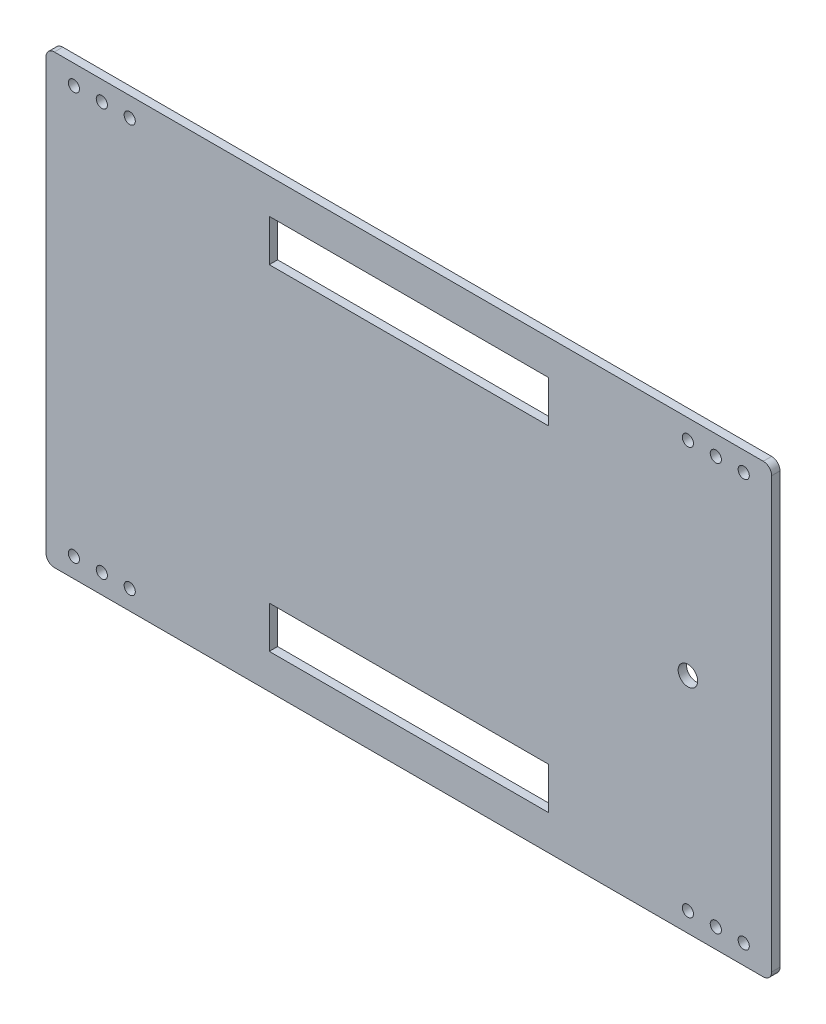
ISO-10303-21;
HEADER;
FILE_DESCRIPTION(('STEP AP214'),'2;1');
FILE_NAME('part.step','',(''),(''),'','','');
FILE_SCHEMA(('AUTOMOTIVE_DESIGN { 1 0 10303 214 1 1 1 1 }'));
ENDSEC;
DATA;
#1=APPLICATION_CONTEXT('core data for automotive mechanical design processes');
#2=APPLICATION_PROTOCOL_DEFINITION('international standard','automotive_design',2000,#1);
#3=PRODUCT_CONTEXT('',#1,'mechanical');
#4=PRODUCT('Part','Part','',(#3));
#5=PRODUCT_RELATED_PRODUCT_CATEGORY('part','',(#4));
#6=PRODUCT_DEFINITION_FORMATION('','',#4);
#7=PRODUCT_DEFINITION_CONTEXT('part definition',#1,'design');
#8=PRODUCT_DEFINITION('design','',#6,#7);
#9=PRODUCT_DEFINITION_SHAPE('','',#8);
#10=(LENGTH_UNIT() NAMED_UNIT(*) SI_UNIT(.MILLI.,.METRE.));
#11=(NAMED_UNIT(*) PLANE_ANGLE_UNIT() SI_UNIT($,.RADIAN.));
#12=(NAMED_UNIT(*) SI_UNIT($,.STERADIAN.) SOLID_ANGLE_UNIT());
#13=UNCERTAINTY_MEASURE_WITH_UNIT(LENGTH_MEASURE(1.E-05),#10,'distance_accuracy_value','');
#14=(GEOMETRIC_REPRESENTATION_CONTEXT(3) GLOBAL_UNCERTAINTY_ASSIGNED_CONTEXT((#13)) GLOBAL_UNIT_ASSIGNED_CONTEXT((#10,
#11,#12)) REPRESENTATION_CONTEXT('',''));
#15=CARTESIAN_POINT('',(0.,0.,0.));
#16=DIRECTION('',(0.,0.,1.));
#17=DIRECTION('',(1.,0.,0.));
#18=AXIS2_PLACEMENT_3D('',#15,#16,#17);
#19=CARTESIAN_POINT('',(127.,77.,3.));
#20=DIRECTION('',(0.,0.,1.));
#21=DIRECTION('',(1.,0.,0.));
#22=AXIS2_PLACEMENT_3D('',#19,#20,#21);
#23=PLANE('',#22);
#24=CARTESIAN_POINT('',(100.,0.,3.));
#25=DIRECTION('',(0.,0.,1.));
#26=DIRECTION('',(1.,0.,0.));
#27=AXIS2_PLACEMENT_3D('',#24,#25,#26);
#28=CIRCLE('',#27,3.50000000000001);
#29=CARTESIAN_POINT('',(103.5,0.,3.));
#30=VERTEX_POINT('',#29);
#31=EDGE_CURVE('E901',#30,#30,#28,.T.);
#32=ORIENTED_EDGE('',*,*,#31,.F.);
#33=EDGE_LOOP('',(#32));
#34=FACE_BOUND('',#33,.T.);
#35=CARTESIAN_POINT('',(100.,-73.,3.));
#36=DIRECTION('',(0.,0.,1.));
#37=DIRECTION('',(1.,0.,0.));
#38=AXIS2_PLACEMENT_3D('',#35,#36,#37);
#39=CIRCLE('',#38,2.);
#40=CARTESIAN_POINT('',(102.,-73.,3.));
#41=VERTEX_POINT('',#40);
#42=EDGE_CURVE('E258',#41,#41,#39,.T.);
#43=ORIENTED_EDGE('',*,*,#42,.F.);
#44=EDGE_LOOP('',(#43));
#45=FACE_BOUND('',#44,.T.);
#46=CARTESIAN_POINT('',(-100.,73.,3.));
#47=DIRECTION('',(0.,0.,1.));
#48=DIRECTION('',(1.,0.,0.));
#49=AXIS2_PLACEMENT_3D('',#46,#47,#48);
#50=CIRCLE('',#49,2.);
#51=CARTESIAN_POINT('',(-98.,73.,3.));
#52=VERTEX_POINT('',#51);
#53=EDGE_CURVE('E274',#52,#52,#50,.T.);
#54=ORIENTED_EDGE('',*,*,#53,.F.);
#55=EDGE_LOOP('',(#54));
#56=FACE_BOUND('',#55,.T.);
#57=CARTESIAN_POINT('',(-120.,-73.,3.));
#58=DIRECTION('',(0.,0.,1.));
#59=DIRECTION('',(1.,0.,0.));
#60=AXIS2_PLACEMENT_3D('',#57,#58,#59);
#61=CIRCLE('',#60,2.00000000000002);
#62=CARTESIAN_POINT('',(-118.,-73.,3.));
#63=VERTEX_POINT('',#62);
#64=EDGE_CURVE('E290',#63,#63,#61,.T.);
#65=ORIENTED_EDGE('',*,*,#64,.F.);
#66=EDGE_LOOP('',(#65));
#67=FACE_BOUND('',#66,.T.);
#68=CARTESIAN_POINT('',(-120.,73.,3.));
#69=DIRECTION('',(0.,0.,1.));
#70=DIRECTION('',(1.,0.,0.));
#71=AXIS2_PLACEMENT_3D('',#68,#69,#70);
#72=CIRCLE('',#71,2.);
#73=CARTESIAN_POINT('',(-118.,73.,3.));
#74=VERTEX_POINT('',#73);
#75=EDGE_CURVE('E306',#74,#74,#72,.T.);
#76=ORIENTED_EDGE('',*,*,#75,.F.);
#77=EDGE_LOOP('',(#76));
#78=FACE_BOUND('',#77,.T.);
#79=CARTESIAN_POINT('',(110.,-73.,3.));
#80=DIRECTION('',(0.,0.,1.));
#81=DIRECTION('',(1.,0.,0.));
#82=AXIS2_PLACEMENT_3D('',#79,#80,#81);
#83=CIRCLE('',#82,2.);
#84=CARTESIAN_POINT('',(112.,-73.,3.));
#85=VERTEX_POINT('',#84);
#86=EDGE_CURVE('E322',#85,#85,#83,.T.);
#87=ORIENTED_EDGE('',*,*,#86,.F.);
#88=EDGE_LOOP('',(#87));
#89=FACE_BOUND('',#88,.T.);
#90=CARTESIAN_POINT('',(-110.,73.,3.));
#91=DIRECTION('',(0.,0.,1.));
#92=DIRECTION('',(1.,0.,0.));
#93=AXIS2_PLACEMENT_3D('',#90,#91,#92);
#94=CIRCLE('',#93,2.);
#95=CARTESIAN_POINT('',(-108.,73.,3.));
#96=VERTEX_POINT('',#95);
#97=EDGE_CURVE('E338',#96,#96,#94,.T.);
#98=ORIENTED_EDGE('',*,*,#97,.F.);
#99=EDGE_LOOP('',(#98));
#100=FACE_BOUND('',#99,.T.);
#101=CARTESIAN_POINT('',(127.,77.,3.));
#102=DIRECTION('',(0.,0.,1.));
#103=DIRECTION('',(1.,0.,0.));
#104=AXIS2_PLACEMENT_3D('',#101,#102,#103);
#105=CIRCLE('',#104,3.);
#106=CARTESIAN_POINT('',(130.,77.,3.));
#107=VERTEX_POINT('',#106);
#108=CARTESIAN_POINT('',(127.,80.,3.));
#109=VERTEX_POINT('',#108);
#110=EDGE_CURVE('E346',#107,#109,#105,.T.);
#111=ORIENTED_EDGE('',*,*,#110,.T.);
#112=DIRECTION('',(-1.,0.,0.));
#113=VECTOR('',#112,1.);
#114=CARTESIAN_POINT('',(127.,80.,3.));
#115=LINE('',#114,#113);
#116=CARTESIAN_POINT('',(-127.,80.,3.));
#117=VERTEX_POINT('',#116);
#118=EDGE_CURVE('E350',#109,#117,#115,.T.);
#119=ORIENTED_EDGE('',*,*,#118,.T.);
#120=CARTESIAN_POINT('',(-127.,77.,3.));
#121=DIRECTION('',(0.,0.,1.));
#122=DIRECTION('',(1.,0.,0.));
#123=AXIS2_PLACEMENT_3D('',#120,#121,#122);
#124=CIRCLE('',#123,3.);
#125=CARTESIAN_POINT('',(-130.,77.,3.));
#126=VERTEX_POINT('',#125);
#127=EDGE_CURVE('E354',#117,#126,#124,.T.);
#128=ORIENTED_EDGE('',*,*,#127,.T.);
#129=DIRECTION('',(0.,-1.,0.));
#130=VECTOR('',#129,1.);
#131=CARTESIAN_POINT('',(-130.,77.,3.));
#132=LINE('',#131,#130);
#133=CARTESIAN_POINT('',(-130.,-77.,3.));
#134=VERTEX_POINT('',#133);
#135=EDGE_CURVE('E357',#126,#134,#132,.T.);
#136=ORIENTED_EDGE('',*,*,#135,.T.);
#137=CARTESIAN_POINT('',(-127.,-77.,3.));
#138=DIRECTION('',(0.,0.,1.));
#139=DIRECTION('',(1.,0.,0.));
#140=AXIS2_PLACEMENT_3D('',#137,#138,#139);
#141=CIRCLE('',#140,3.);
#142=CARTESIAN_POINT('',(-127.,-80.,3.));
#143=VERTEX_POINT('',#142);
#144=EDGE_CURVE('E360',#134,#143,#141,.T.);
#145=ORIENTED_EDGE('',*,*,#144,.T.);
#146=DIRECTION('',(1.,0.,0.));
#147=VECTOR('',#146,1.);
#148=CARTESIAN_POINT('',(-127.,-80.,3.));
#149=LINE('',#148,#147);
#150=CARTESIAN_POINT('',(127.,-80.,3.));
#151=VERTEX_POINT('',#150);
#152=EDGE_CURVE('E363',#143,#151,#149,.T.);
#153=ORIENTED_EDGE('',*,*,#152,.T.);
#154=CARTESIAN_POINT('',(127.,-77.,3.));
#155=DIRECTION('',(0.,0.,1.));
#156=DIRECTION('',(1.,0.,0.));
#157=AXIS2_PLACEMENT_3D('',#154,#155,#156);
#158=CIRCLE('',#157,3.);
#159=CARTESIAN_POINT('',(130.,-77.,3.));
#160=VERTEX_POINT('',#159);
#161=EDGE_CURVE('E366',#151,#160,#158,.T.);
#162=ORIENTED_EDGE('',*,*,#161,.T.);
#163=DIRECTION('',(0.,1.,0.));
#164=VECTOR('',#163,1.);
#165=CARTESIAN_POINT('',(130.,-77.,3.));
#166=LINE('',#165,#164);
#167=EDGE_CURVE('E369',#160,#107,#166,.T.);
#168=ORIENTED_EDGE('',*,*,#167,.T.);
#169=EDGE_LOOP('',(#111,#119,#128,#136,#145,#153,#162,#168));
#170=FACE_BOUND('',#169,.T.);
#171=CARTESIAN_POINT('',(110.,73.,3.));
#172=DIRECTION('',(0.,0.,1.));
#173=DIRECTION('',(1.,0.,0.));
#174=AXIS2_PLACEMENT_3D('',#171,#172,#173);
#175=CIRCLE('',#174,2.);
#176=CARTESIAN_POINT('',(112.,73.,3.));
#177=VERTEX_POINT('',#176);
#178=EDGE_CURVE('E330',#177,#177,#175,.T.);
#179=ORIENTED_EDGE('',*,*,#178,.F.);
#180=EDGE_LOOP('',(#179));
#181=FACE_BOUND('',#180,.T.);
#182=CARTESIAN_POINT('',(-110.,-73.,3.));
#183=DIRECTION('',(0.,0.,1.));
#184=DIRECTION('',(1.,0.,0.));
#185=AXIS2_PLACEMENT_3D('',#182,#183,#184);
#186=CIRCLE('',#185,2.);
#187=CARTESIAN_POINT('',(-108.,-73.,3.));
#188=VERTEX_POINT('',#187);
#189=EDGE_CURVE('E314',#188,#188,#186,.T.);
#190=ORIENTED_EDGE('',*,*,#189,.F.);
#191=EDGE_LOOP('',(#190));
#192=FACE_BOUND('',#191,.T.);
#193=CARTESIAN_POINT('',(120.,73.,3.));
#194=DIRECTION('',(0.,0.,1.));
#195=DIRECTION('',(1.,0.,0.));
#196=AXIS2_PLACEMENT_3D('',#193,#194,#195);
#197=CIRCLE('',#196,2.);
#198=CARTESIAN_POINT('',(122.,73.,3.));
#199=VERTEX_POINT('',#198);
#200=EDGE_CURVE('E298',#199,#199,#197,.T.);
#201=ORIENTED_EDGE('',*,*,#200,.F.);
#202=EDGE_LOOP('',(#201));
#203=FACE_BOUND('',#202,.T.);
#204=CARTESIAN_POINT('',(120.,-73.,3.));
#205=DIRECTION('',(0.,0.,1.));
#206=DIRECTION('',(1.,0.,0.));
#207=AXIS2_PLACEMENT_3D('',#204,#205,#206);
#208=CIRCLE('',#207,2.);
#209=CARTESIAN_POINT('',(122.,-73.,3.));
#210=VERTEX_POINT('',#209);
#211=EDGE_CURVE('E282',#210,#210,#208,.T.);
#212=ORIENTED_EDGE('',*,*,#211,.F.);
#213=EDGE_LOOP('',(#212));
#214=FACE_BOUND('',#213,.T.);
#215=CARTESIAN_POINT('',(100.,73.,3.));
#216=DIRECTION('',(0.,0.,1.));
#217=DIRECTION('',(1.,0.,0.));
#218=AXIS2_PLACEMENT_3D('',#215,#216,#217);
#219=CIRCLE('',#218,2.);
#220=CARTESIAN_POINT('',(102.,73.,3.));
#221=VERTEX_POINT('',#220);
#222=EDGE_CURVE('E266',#221,#221,#219,.T.);
#223=ORIENTED_EDGE('',*,*,#222,.F.);
#224=EDGE_LOOP('',(#223));
#225=FACE_BOUND('',#224,.T.);
#226=CARTESIAN_POINT('',(-100.,-73.,3.));
#227=DIRECTION('',(0.,0.,1.));
#228=DIRECTION('',(1.,0.,0.));
#229=AXIS2_PLACEMENT_3D('',#226,#227,#228);
#230=CIRCLE('',#229,2.00000000000002);
#231=CARTESIAN_POINT('',(-98.,-73.,3.));
#232=VERTEX_POINT('',#231);
#233=EDGE_CURVE('E250',#232,#232,#230,.T.);
#234=ORIENTED_EDGE('',*,*,#233,.F.);
#235=EDGE_LOOP('',(#234));
#236=FACE_BOUND('',#235,.T.);
#237=DIRECTION('',(-1.,0.,0.));
#238=VECTOR('',#237,1.);
#239=CARTESIAN_POINT('',(50.,67.5,3.));
#240=LINE('',#239,#238);
#241=CARTESIAN_POINT('',(50.,67.5,3.));
#242=VERTEX_POINT('',#241);
#243=CARTESIAN_POINT('',(-50.,67.5,3.));
#244=VERTEX_POINT('',#243);
#245=EDGE_CURVE('E210',#242,#244,#240,.T.);
#246=ORIENTED_EDGE('',*,*,#245,.F.);
#247=DIRECTION('',(0.,1.,0.));
#248=VECTOR('',#247,1.);
#249=CARTESIAN_POINT('',(50.,52.5,3.));
#250=LINE('',#249,#248);
#251=CARTESIAN_POINT('',(50.,52.5,3.));
#252=VERTEX_POINT('',#251);
#253=EDGE_CURVE('E207',#252,#242,#250,.T.);
#254=ORIENTED_EDGE('',*,*,#253,.F.);
#255=DIRECTION('',(1.,0.,0.));
#256=VECTOR('',#255,1.);
#257=CARTESIAN_POINT('',(-50.,52.5,3.));
#258=LINE('',#257,#256);
#259=CARTESIAN_POINT('',(-50.,52.5,3.));
#260=VERTEX_POINT('',#259);
#261=EDGE_CURVE('E218',#260,#252,#258,.T.);
#262=ORIENTED_EDGE('',*,*,#261,.F.);
#263=DIRECTION('',(0.,-1.,0.));
#264=VECTOR('',#263,1.);
#265=CARTESIAN_POINT('',(-50.,67.5,3.));
#266=LINE('',#265,#264);
#267=EDGE_CURVE('E214',#244,#260,#266,.T.);
#268=ORIENTED_EDGE('',*,*,#267,.F.);
#269=EDGE_LOOP('',(#246,#254,#262,#268));
#270=FACE_BOUND('',#269,.T.);
#271=DIRECTION('',(1.,0.,0.));
#272=VECTOR('',#271,1.);
#273=CARTESIAN_POINT('',(-50.,-67.5,3.));
#274=LINE('',#273,#272);
#275=CARTESIAN_POINT('',(-50.,-67.5,3.));
#276=VERTEX_POINT('',#275);
#277=CARTESIAN_POINT('',(50.,-67.5,3.));
#278=VERTEX_POINT('',#277);
#279=EDGE_CURVE('E166',#276,#278,#274,.T.);
#280=ORIENTED_EDGE('',*,*,#279,.F.);
#281=DIRECTION('',(0.,-1.,0.));
#282=VECTOR('',#281,1.);
#283=CARTESIAN_POINT('',(-50.,-52.5,3.));
#284=LINE('',#283,#282);
#285=CARTESIAN_POINT('',(-50.,-52.5,3.));
#286=VERTEX_POINT('',#285);
#287=EDGE_CURVE('E157',#286,#276,#284,.T.);
#288=ORIENTED_EDGE('',*,*,#287,.F.);
#289=DIRECTION('',(-1.,0.,0.));
#290=VECTOR('',#289,1.);
#291=CARTESIAN_POINT('',(50.,-52.5,3.));
#292=LINE('',#291,#290);
#293=CARTESIAN_POINT('',(50.,-52.5,3.));
#294=VERTEX_POINT('',#293);
#295=EDGE_CURVE('E183',#294,#286,#292,.T.);
#296=ORIENTED_EDGE('',*,*,#295,.F.);
#297=DIRECTION('',(0.,1.,0.));
#298=VECTOR('',#297,1.);
#299=CARTESIAN_POINT('',(50.,-67.5,3.));
#300=LINE('',#299,#298);
#301=EDGE_CURVE('E179',#278,#294,#300,.T.);
#302=ORIENTED_EDGE('',*,*,#301,.F.);
#303=EDGE_LOOP('',(#280,#288,#296,#302));
#304=FACE_BOUND('',#303,.T.);
#305=ADVANCED_FACE('F43',(#34,#45,#56,#67,#78,#89,#100,#170,#181,#192,#203,#214,#225,#236,#270,
#304),#23,.T.);
#306=CARTESIAN_POINT('',(127.,77.,0.));
#307=DIRECTION('',(0.,0.,1.));
#308=DIRECTION('',(1.,0.,0.));
#309=AXIS2_PLACEMENT_3D('',#306,#307,#308);
#310=PLANE('',#309);
#311=CARTESIAN_POINT('',(100.,0.,0.));
#312=DIRECTION('',(0.,0.,1.));
#313=DIRECTION('',(1.,0.,0.));
#314=AXIS2_PLACEMENT_3D('',#311,#312,#313);
#315=CIRCLE('',#314,3.50000000000001);
#316=CARTESIAN_POINT('',(103.5,0.,0.));
#317=VERTEX_POINT('',#316);
#318=EDGE_CURVE('E191',#317,#317,#315,.T.);
#319=ORIENTED_EDGE('',*,*,#318,.T.);
#320=EDGE_LOOP('',(#319));
#321=FACE_BOUND('',#320,.T.);
#322=DIRECTION('',(0.,1.,0.));
#323=VECTOR('',#322,1.);
#324=CARTESIAN_POINT('',(50.,52.5,0.));
#325=LINE('',#324,#323);
#326=CARTESIAN_POINT('',(50.,52.5,0.));
#327=VERTEX_POINT('',#326);
#328=CARTESIAN_POINT('',(50.,67.5,0.));
#329=VERTEX_POINT('',#328);
#330=EDGE_CURVE('E175',#327,#329,#325,.T.);
#331=ORIENTED_EDGE('',*,*,#330,.T.);
#332=DIRECTION('',(-1.,0.,0.));
#333=VECTOR('',#332,1.);
#334=CARTESIAN_POINT('',(50.,67.5,0.));
#335=LINE('',#334,#333);
#336=CARTESIAN_POINT('',(-50.,67.5,0.));
#337=VERTEX_POINT('',#336);
#338=EDGE_CURVE('E225',#329,#337,#335,.T.);
#339=ORIENTED_EDGE('',*,*,#338,.T.);
#340=DIRECTION('',(0.,-1.,0.));
#341=VECTOR('',#340,1.);
#342=CARTESIAN_POINT('',(-50.,67.5,0.));
#343=LINE('',#342,#341);
#344=CARTESIAN_POINT('',(-50.,52.5,0.));
#345=VERTEX_POINT('',#344);
#346=EDGE_CURVE('E229',#337,#345,#343,.T.);
#347=ORIENTED_EDGE('',*,*,#346,.T.);
#348=DIRECTION('',(1.,0.,0.));
#349=VECTOR('',#348,1.);
#350=CARTESIAN_POINT('',(-50.,52.5,0.));
#351=LINE('',#350,#349);
#352=EDGE_CURVE('E211',#345,#327,#351,.T.);
#353=ORIENTED_EDGE('',*,*,#352,.T.);
#354=EDGE_LOOP('',(#331,#339,#347,#353));
#355=FACE_BOUND('',#354,.T.);
#356=CARTESIAN_POINT('',(127.,77.,0.));
#357=DIRECTION('',(0.,0.,1.));
#358=DIRECTION('',(1.,0.,0.));
#359=AXIS2_PLACEMENT_3D('',#356,#357,#358);
#360=CIRCLE('',#359,3.);
#361=CARTESIAN_POINT('',(130.,77.,0.));
#362=VERTEX_POINT('',#361);
#363=CARTESIAN_POINT('',(127.,80.,0.));
#364=VERTEX_POINT('',#363);
#365=EDGE_CURVE('E342',#362,#364,#360,.T.);
#366=ORIENTED_EDGE('',*,*,#365,.F.);
#367=DIRECTION('',(0.,1.,0.));
#368=VECTOR('',#367,1.);
#369=CARTESIAN_POINT('',(130.,-77.,0.));
#370=LINE('',#369,#368);
#371=CARTESIAN_POINT('',(130.,-77.,0.));
#372=VERTEX_POINT('',#371);
#373=EDGE_CURVE('E351',#372,#362,#370,.T.);
#374=ORIENTED_EDGE('',*,*,#373,.F.);
#375=CARTESIAN_POINT('',(127.,-77.,0.));
#376=DIRECTION('',(0.,0.,1.));
#377=DIRECTION('',(1.,0.,0.));
#378=AXIS2_PLACEMENT_3D('',#375,#376,#377);
#379=CIRCLE('',#378,3.);
#380=CARTESIAN_POINT('',(127.,-80.,0.));
#381=VERTEX_POINT('',#380);
#382=EDGE_CURVE('E391',#381,#372,#379,.T.);
#383=ORIENTED_EDGE('',*,*,#382,.F.);
#384=DIRECTION('',(1.,0.,0.));
#385=VECTOR('',#384,1.);
#386=CARTESIAN_POINT('',(-127.,-80.,0.));
#387=LINE('',#386,#385);
#388=CARTESIAN_POINT('',(-127.,-80.,0.));
#389=VERTEX_POINT('',#388);
#390=EDGE_CURVE('E388',#389,#381,#387,.T.);
#391=ORIENTED_EDGE('',*,*,#390,.F.);
#392=CARTESIAN_POINT('',(-127.,-77.,0.));
#393=DIRECTION('',(0.,0.,1.));
#394=DIRECTION('',(1.,0.,0.));
#395=AXIS2_PLACEMENT_3D('',#392,#393,#394);
#396=CIRCLE('',#395,3.);
#397=CARTESIAN_POINT('',(-130.,-77.,0.));
#398=VERTEX_POINT('',#397);
#399=EDGE_CURVE('E385',#398,#389,#396,.T.);
#400=ORIENTED_EDGE('',*,*,#399,.F.);
#401=DIRECTION('',(0.,-1.,0.));
#402=VECTOR('',#401,1.);
#403=CARTESIAN_POINT('',(-130.,77.,0.));
#404=LINE('',#403,#402);
#405=CARTESIAN_POINT('',(-130.,77.,0.));
#406=VERTEX_POINT('',#405);
#407=EDGE_CURVE('E382',#406,#398,#404,.T.);
#408=ORIENTED_EDGE('',*,*,#407,.F.);
#409=CARTESIAN_POINT('',(-127.,77.,0.));
#410=DIRECTION('',(0.,0.,1.));
#411=DIRECTION('',(1.,0.,0.));
#412=AXIS2_PLACEMENT_3D('',#409,#410,#411);
#413=CIRCLE('',#412,3.);
#414=CARTESIAN_POINT('',(-127.,80.,0.));
#415=VERTEX_POINT('',#414);
#416=EDGE_CURVE('E379',#415,#406,#413,.T.);
#417=ORIENTED_EDGE('',*,*,#416,.F.);
#418=DIRECTION('',(-1.,0.,0.));
#419=VECTOR('',#418,1.);
#420=CARTESIAN_POINT('',(127.,80.,0.));
#421=LINE('',#420,#419);
#422=EDGE_CURVE('E376',#364,#415,#421,.T.);
#423=ORIENTED_EDGE('',*,*,#422,.F.);
#424=EDGE_LOOP('',(#366,#374,#383,#391,#400,#408,#417,#423));
#425=FACE_BOUND('',#424,.T.);
#426=CARTESIAN_POINT('',(-110.,73.,0.));
#427=DIRECTION('',(0.,0.,1.));
#428=DIRECTION('',(1.,0.,0.));
#429=AXIS2_PLACEMENT_3D('',#426,#427,#428);
#430=CIRCLE('',#429,2.);
#431=CARTESIAN_POINT('',(-108.,73.,0.));
#432=VERTEX_POINT('',#431);
#433=EDGE_CURVE('E334',#432,#432,#430,.T.);
#434=ORIENTED_EDGE('',*,*,#433,.T.);
#435=EDGE_LOOP('',(#434));
#436=FACE_BOUND('',#435,.T.);
#437=CARTESIAN_POINT('',(110.,73.,0.));
#438=DIRECTION('',(0.,0.,1.));
#439=DIRECTION('',(1.,0.,0.));
#440=AXIS2_PLACEMENT_3D('',#437,#438,#439);
#441=CIRCLE('',#440,2.);
#442=CARTESIAN_POINT('',(112.,73.,0.));
#443=VERTEX_POINT('',#442);
#444=EDGE_CURVE('E326',#443,#443,#441,.T.);
#445=ORIENTED_EDGE('',*,*,#444,.T.);
#446=EDGE_LOOP('',(#445));
#447=FACE_BOUND('',#446,.T.);
#448=CARTESIAN_POINT('',(110.,-73.,0.));
#449=DIRECTION('',(0.,0.,1.));
#450=DIRECTION('',(1.,0.,0.));
#451=AXIS2_PLACEMENT_3D('',#448,#449,#450);
#452=CIRCLE('',#451,2.);
#453=CARTESIAN_POINT('',(112.,-73.,0.));
#454=VERTEX_POINT('',#453);
#455=EDGE_CURVE('E318',#454,#454,#452,.T.);
#456=ORIENTED_EDGE('',*,*,#455,.T.);
#457=EDGE_LOOP('',(#456));
#458=FACE_BOUND('',#457,.T.);
#459=CARTESIAN_POINT('',(-110.,-73.,0.));
#460=DIRECTION('',(0.,0.,1.));
#461=DIRECTION('',(1.,0.,0.));
#462=AXIS2_PLACEMENT_3D('',#459,#460,#461);
#463=CIRCLE('',#462,2.);
#464=CARTESIAN_POINT('',(-108.,-73.,0.));
#465=VERTEX_POINT('',#464);
#466=EDGE_CURVE('E310',#465,#465,#463,.T.);
#467=ORIENTED_EDGE('',*,*,#466,.T.);
#468=EDGE_LOOP('',(#467));
#469=FACE_BOUND('',#468,.T.);
#470=CARTESIAN_POINT('',(-120.,73.,0.));
#471=DIRECTION('',(0.,0.,1.));
#472=DIRECTION('',(1.,0.,0.));
#473=AXIS2_PLACEMENT_3D('',#470,#471,#472);
#474=CIRCLE('',#473,2.);
#475=CARTESIAN_POINT('',(-118.,73.,0.));
#476=VERTEX_POINT('',#475);
#477=EDGE_CURVE('E302',#476,#476,#474,.T.);
#478=ORIENTED_EDGE('',*,*,#477,.T.);
#479=EDGE_LOOP('',(#478));
#480=FACE_BOUND('',#479,.T.);
#481=CARTESIAN_POINT('',(120.,73.,0.));
#482=DIRECTION('',(0.,0.,1.));
#483=DIRECTION('',(1.,0.,0.));
#484=AXIS2_PLACEMENT_3D('',#481,#482,#483);
#485=CIRCLE('',#484,2.);
#486=CARTESIAN_POINT('',(122.,73.,0.));
#487=VERTEX_POINT('',#486);
#488=EDGE_CURVE('E294',#487,#487,#485,.T.);
#489=ORIENTED_EDGE('',*,*,#488,.T.);
#490=EDGE_LOOP('',(#489));
#491=FACE_BOUND('',#490,.T.);
#492=CARTESIAN_POINT('',(-120.,-73.,0.));
#493=DIRECTION('',(0.,0.,1.));
#494=DIRECTION('',(1.,0.,0.));
#495=AXIS2_PLACEMENT_3D('',#492,#493,#494);
#496=CIRCLE('',#495,2.00000000000002);
#497=CARTESIAN_POINT('',(-118.,-73.,0.));
#498=VERTEX_POINT('',#497);
#499=EDGE_CURVE('E286',#498,#498,#496,.T.);
#500=ORIENTED_EDGE('',*,*,#499,.T.);
#501=EDGE_LOOP('',(#500));
#502=FACE_BOUND('',#501,.T.);
#503=CARTESIAN_POINT('',(120.,-73.,0.));
#504=DIRECTION('',(0.,0.,1.));
#505=DIRECTION('',(1.,0.,0.));
#506=AXIS2_PLACEMENT_3D('',#503,#504,#505);
#507=CIRCLE('',#506,2.);
#508=CARTESIAN_POINT('',(122.,-73.,0.));
#509=VERTEX_POINT('',#508);
#510=EDGE_CURVE('E278',#509,#509,#507,.T.);
#511=ORIENTED_EDGE('',*,*,#510,.T.);
#512=EDGE_LOOP('',(#511));
#513=FACE_BOUND('',#512,.T.);
#514=CARTESIAN_POINT('',(-100.,73.,0.));
#515=DIRECTION('',(0.,0.,1.));
#516=DIRECTION('',(1.,0.,0.));
#517=AXIS2_PLACEMENT_3D('',#514,#515,#516);
#518=CIRCLE('',#517,2.);
#519=CARTESIAN_POINT('',(-98.,73.,0.));
#520=VERTEX_POINT('',#519);
#521=EDGE_CURVE('E270',#520,#520,#518,.T.);
#522=ORIENTED_EDGE('',*,*,#521,.T.);
#523=EDGE_LOOP('',(#522));
#524=FACE_BOUND('',#523,.T.);
#525=CARTESIAN_POINT('',(100.,73.,0.));
#526=DIRECTION('',(0.,0.,1.));
#527=DIRECTION('',(1.,0.,0.));
#528=AXIS2_PLACEMENT_3D('',#525,#526,#527);
#529=CIRCLE('',#528,2.);
#530=CARTESIAN_POINT('',(102.,73.,0.));
#531=VERTEX_POINT('',#530);
#532=EDGE_CURVE('E262',#531,#531,#529,.T.);
#533=ORIENTED_EDGE('',*,*,#532,.T.);
#534=EDGE_LOOP('',(#533));
#535=FACE_BOUND('',#534,.T.);
#536=CARTESIAN_POINT('',(100.,-73.,0.));
#537=DIRECTION('',(0.,0.,1.));
#538=DIRECTION('',(1.,0.,0.));
#539=AXIS2_PLACEMENT_3D('',#536,#537,#538);
#540=CIRCLE('',#539,2.);
#541=CARTESIAN_POINT('',(102.,-73.,0.));
#542=VERTEX_POINT('',#541);
#543=EDGE_CURVE('E254',#542,#542,#540,.T.);
#544=ORIENTED_EDGE('',*,*,#543,.T.);
#545=EDGE_LOOP('',(#544));
#546=FACE_BOUND('',#545,.T.);
#547=CARTESIAN_POINT('',(-100.,-73.,0.));
#548=DIRECTION('',(0.,0.,1.));
#549=DIRECTION('',(1.,0.,0.));
#550=AXIS2_PLACEMENT_3D('',#547,#548,#549);
#551=CIRCLE('',#550,2.00000000000002);
#552=CARTESIAN_POINT('',(-98.,-73.,0.));
#553=VERTEX_POINT('',#552);
#554=EDGE_CURVE('E249',#553,#553,#551,.T.);
#555=ORIENTED_EDGE('',*,*,#554,.T.);
#556=EDGE_LOOP('',(#555));
#557=FACE_BOUND('',#556,.T.);
#558=DIRECTION('',(0.,-1.,0.));
#559=VECTOR('',#558,1.);
#560=CARTESIAN_POINT('',(-50.,-52.5,0.));
#561=LINE('',#560,#559);
#562=CARTESIAN_POINT('',(-50.,-52.5,0.));
#563=VERTEX_POINT('',#562);
#564=CARTESIAN_POINT('',(-50.,-67.5,0.));
#565=VERTEX_POINT('',#564);
#566=EDGE_CURVE('E67',#563,#565,#561,.T.);
#567=ORIENTED_EDGE('',*,*,#566,.T.);
#568=DIRECTION('',(1.,0.,0.));
#569=VECTOR('',#568,1.);
#570=CARTESIAN_POINT('',(-50.,-67.5,0.));
#571=LINE('',#570,#569);
#572=CARTESIAN_POINT('',(50.,-67.5,0.));
#573=VERTEX_POINT('',#572);
#574=EDGE_CURVE('E173',#565,#573,#571,.T.);
#575=ORIENTED_EDGE('',*,*,#574,.T.);
#576=DIRECTION('',(0.,1.,0.));
#577=VECTOR('',#576,1.);
#578=CARTESIAN_POINT('',(50.,-67.5,0.));
#579=LINE('',#578,#577);
#580=CARTESIAN_POINT('',(50.,-52.5,0.));
#581=VERTEX_POINT('',#580);
#582=EDGE_CURVE('E194',#573,#581,#579,.T.);
#583=ORIENTED_EDGE('',*,*,#582,.T.);
#584=DIRECTION('',(-1.,0.,0.));
#585=VECTOR('',#584,1.);
#586=CARTESIAN_POINT('',(50.,-52.5,0.));
#587=LINE('',#586,#585);
#588=EDGE_CURVE('E167',#581,#563,#587,.T.);
#589=ORIENTED_EDGE('',*,*,#588,.T.);
#590=EDGE_LOOP('',(#567,#575,#583,#589));
#591=FACE_BOUND('',#590,.T.);
#592=ADVANCED_FACE('F430',(#321,#355,#425,#436,#447,#458,#469,#480,#491,#502,#513,#524,#535,
#546,#557,#591),#310,.F.);
#593=CARTESIAN_POINT('',(127.,77.,3.));
#594=DIRECTION('',(0.,0.,-1.));
#595=DIRECTION('',(-1.,0.,0.));
#596=AXIS2_PLACEMENT_3D('',#593,#594,#595);
#597=CYLINDRICAL_SURFACE('',#596,3.);
#598=ORIENTED_EDGE('',*,*,#365,.T.);
#599=DIRECTION('',(0.,0.,-1.));
#600=VECTOR('',#599,1.);
#601=CARTESIAN_POINT('',(127.,80.,3.));
#602=LINE('',#601,#600);
#603=EDGE_CURVE('E11',#109,#364,#602,.T.);
#604=ORIENTED_EDGE('',*,*,#603,.F.);
#605=ORIENTED_EDGE('',*,*,#110,.F.);
#606=DIRECTION('',(0.,0.,-1.));
#607=VECTOR('',#606,1.);
#608=CARTESIAN_POINT('',(130.,77.,3.));
#609=LINE('',#608,#607);
#610=EDGE_CURVE('E372',#107,#362,#609,.T.);
#611=ORIENTED_EDGE('',*,*,#610,.T.);
#612=EDGE_LOOP('',(#598,#604,#605,#611));
#613=FACE_BOUND('',#612,.T.);
#614=ADVANCED_FACE('F45',(#613),#597,.T.);
#615=CARTESIAN_POINT('',(127.,80.,3.));
#616=DIRECTION('',(0.,-1.,0.));
#617=DIRECTION('',(0.,0.,-1.));
#618=AXIS2_PLACEMENT_3D('',#615,#616,#617);
#619=PLANE('',#618);
#620=ORIENTED_EDGE('',*,*,#422,.T.);
#621=DIRECTION('',(0.,0.,-1.));
#622=VECTOR('',#621,1.);
#623=CARTESIAN_POINT('',(-127.,80.,3.));
#624=LINE('',#623,#622);
#625=EDGE_CURVE('E52',#117,#415,#624,.T.);
#626=ORIENTED_EDGE('',*,*,#625,.F.);
#627=ORIENTED_EDGE('',*,*,#118,.F.);
#628=ORIENTED_EDGE('',*,*,#603,.T.);
#629=EDGE_LOOP('',(#620,#626,#627,#628));
#630=FACE_BOUND('',#629,.T.);
#631=ADVANCED_FACE('F448',(#630),#619,.F.);
#632=CARTESIAN_POINT('',(-127.,77.,3.));
#633=DIRECTION('',(0.,0.,-1.));
#634=DIRECTION('',(-1.,0.,0.));
#635=AXIS2_PLACEMENT_3D('',#632,#633,#634);
#636=CYLINDRICAL_SURFACE('',#635,3.);
#637=ORIENTED_EDGE('',*,*,#416,.T.);
#638=DIRECTION('',(0.,0.,-1.));
#639=VECTOR('',#638,1.);
#640=CARTESIAN_POINT('',(-130.,77.,3.));
#641=LINE('',#640,#639);
#642=EDGE_CURVE('E415',#126,#406,#641,.T.);
#643=ORIENTED_EDGE('',*,*,#642,.F.);
#644=ORIENTED_EDGE('',*,*,#127,.F.);
#645=ORIENTED_EDGE('',*,*,#625,.T.);
#646=EDGE_LOOP('',(#637,#643,#644,#645));
#647=FACE_BOUND('',#646,.T.);
#648=ADVANCED_FACE('F424',(#647),#636,.T.);
#649=CARTESIAN_POINT('',(-130.,77.,3.));
#650=DIRECTION('',(1.,0.,0.));
#651=DIRECTION('',(0.,0.,-1.));
#652=AXIS2_PLACEMENT_3D('',#649,#650,#651);
#653=PLANE('',#652);
#654=ORIENTED_EDGE('',*,*,#407,.T.);
#655=DIRECTION('',(0.,0.,-1.));
#656=VECTOR('',#655,1.);
#657=CARTESIAN_POINT('',(-130.,-77.,3.));
#658=LINE('',#657,#656);
#659=EDGE_CURVE('E411',#134,#398,#658,.T.);
#660=ORIENTED_EDGE('',*,*,#659,.F.);
#661=ORIENTED_EDGE('',*,*,#135,.F.);
#662=ORIENTED_EDGE('',*,*,#642,.T.);
#663=EDGE_LOOP('',(#654,#660,#661,#662));
#664=FACE_BOUND('',#663,.T.);
#665=ADVANCED_FACE('F436',(#664),#653,.F.);
#666=CARTESIAN_POINT('',(-127.,-77.,3.));
#667=DIRECTION('',(0.,0.,-1.));
#668=DIRECTION('',(-1.,0.,0.));
#669=AXIS2_PLACEMENT_3D('',#666,#667,#668);
#670=CYLINDRICAL_SURFACE('',#669,3.);
#671=ORIENTED_EDGE('',*,*,#399,.T.);
#672=DIRECTION('',(0.,0.,-1.));
#673=VECTOR('',#672,1.);
#674=CARTESIAN_POINT('',(-127.,-80.,3.));
#675=LINE('',#674,#673);
#676=EDGE_CURVE('E407',#143,#389,#675,.T.);
#677=ORIENTED_EDGE('',*,*,#676,.F.);
#678=ORIENTED_EDGE('',*,*,#144,.F.);
#679=ORIENTED_EDGE('',*,*,#659,.T.);
#680=EDGE_LOOP('',(#671,#677,#678,#679));
#681=FACE_BOUND('',#680,.T.);
#682=ADVANCED_FACE('F440',(#681),#670,.T.);
#683=CARTESIAN_POINT('',(-127.,-80.,3.));
#684=DIRECTION('',(0.,1.,0.));
#685=DIRECTION('',(0.,0.,1.));
#686=AXIS2_PLACEMENT_3D('',#683,#684,#685);
#687=PLANE('',#686);
#688=ORIENTED_EDGE('',*,*,#390,.T.);
#689=DIRECTION('',(0.,0.,-1.));
#690=VECTOR('',#689,1.);
#691=CARTESIAN_POINT('',(127.,-80.,3.));
#692=LINE('',#691,#690);
#693=EDGE_CURVE('E403',#151,#381,#692,.T.);
#694=ORIENTED_EDGE('',*,*,#693,.F.);
#695=ORIENTED_EDGE('',*,*,#152,.F.);
#696=ORIENTED_EDGE('',*,*,#676,.T.);
#697=EDGE_LOOP('',(#688,#694,#695,#696));
#698=FACE_BOUND('',#697,.T.);
#699=ADVANCED_FACE('F461',(#698),#687,.F.);
#700=CARTESIAN_POINT('',(127.,-77.,3.));
#701=DIRECTION('',(0.,0.,-1.));
#702=DIRECTION('',(-1.,0.,0.));
#703=AXIS2_PLACEMENT_3D('',#700,#701,#702);
#704=CYLINDRICAL_SURFACE('',#703,3.);
#705=ORIENTED_EDGE('',*,*,#382,.T.);
#706=DIRECTION('',(0.,0.,-1.));
#707=VECTOR('',#706,1.);
#708=CARTESIAN_POINT('',(130.,-77.,3.));
#709=LINE('',#708,#707);
#710=EDGE_CURVE('E399',#160,#372,#709,.T.);
#711=ORIENTED_EDGE('',*,*,#710,.F.);
#712=ORIENTED_EDGE('',*,*,#161,.F.);
#713=ORIENTED_EDGE('',*,*,#693,.T.);
#714=EDGE_LOOP('',(#705,#711,#712,#713));
#715=FACE_BOUND('',#714,.T.);
#716=ADVANCED_FACE('F459',(#715),#704,.T.);
#717=CARTESIAN_POINT('',(130.,-77.,3.));
#718=DIRECTION('',(-1.,0.,0.));
#719=DIRECTION('',(0.,0.,1.));
#720=AXIS2_PLACEMENT_3D('',#717,#718,#719);
#721=PLANE('',#720);
#722=ORIENTED_EDGE('',*,*,#373,.T.);
#723=ORIENTED_EDGE('',*,*,#610,.F.);
#724=ORIENTED_EDGE('',*,*,#167,.F.);
#725=ORIENTED_EDGE('',*,*,#710,.T.);
#726=EDGE_LOOP('',(#722,#723,#724,#725));
#727=FACE_BOUND('',#726,.T.);
#728=ADVANCED_FACE('F454',(#727),#721,.F.);
#729=CARTESIAN_POINT('',(-110.,73.,3.));
#730=DIRECTION('',(0.,0.,-1.));
#731=DIRECTION('',(-1.,0.,0.));
#732=AXIS2_PLACEMENT_3D('',#729,#730,#731);
#733=CYLINDRICAL_SURFACE('',#732,2.);
#734=ORIENTED_EDGE('',*,*,#97,.T.);
#735=EDGE_LOOP('',(#734));
#736=FACE_BOUND('',#735,.T.);
#737=ORIENTED_EDGE('',*,*,#433,.F.);
#738=EDGE_LOOP('',(#737));
#739=FACE_BOUND('',#738,.T.);
#740=ADVANCED_FACE('F481',(#736,#739),#733,.F.);
#741=CARTESIAN_POINT('',(110.,73.,3.));
#742=DIRECTION('',(0.,0.,-1.));
#743=DIRECTION('',(-1.,0.,0.));
#744=AXIS2_PLACEMENT_3D('',#741,#742,#743);
#745=CYLINDRICAL_SURFACE('',#744,2.);
#746=ORIENTED_EDGE('',*,*,#178,.T.);
#747=EDGE_LOOP('',(#746));
#748=FACE_BOUND('',#747,.T.);
#749=ORIENTED_EDGE('',*,*,#444,.F.);
#750=EDGE_LOOP('',(#749));
#751=FACE_BOUND('',#750,.T.);
#752=ADVANCED_FACE('F488',(#748,#751),#745,.F.);
#753=CARTESIAN_POINT('',(110.,-73.,3.));
#754=DIRECTION('',(0.,0.,-1.));
#755=DIRECTION('',(-1.,0.,0.));
#756=AXIS2_PLACEMENT_3D('',#753,#754,#755);
#757=CYLINDRICAL_SURFACE('',#756,2.);
#758=ORIENTED_EDGE('',*,*,#86,.T.);
#759=EDGE_LOOP('',(#758));
#760=FACE_BOUND('',#759,.T.);
#761=ORIENTED_EDGE('',*,*,#455,.F.);
#762=EDGE_LOOP('',(#761));
#763=FACE_BOUND('',#762,.T.);
#764=ADVANCED_FACE('F493',(#760,#763),#757,.F.);
#765=CARTESIAN_POINT('',(-110.,-73.,3.));
#766=DIRECTION('',(0.,0.,-1.));
#767=DIRECTION('',(-1.,0.,0.));
#768=AXIS2_PLACEMENT_3D('',#765,#766,#767);
#769=CYLINDRICAL_SURFACE('',#768,2.);
#770=ORIENTED_EDGE('',*,*,#189,.T.);
#771=EDGE_LOOP('',(#770));
#772=FACE_BOUND('',#771,.T.);
#773=ORIENTED_EDGE('',*,*,#466,.F.);
#774=EDGE_LOOP('',(#773));
#775=FACE_BOUND('',#774,.T.);
#776=ADVANCED_FACE('F587',(#772,#775),#769,.F.);
#777=CARTESIAN_POINT('',(-120.,73.,3.));
#778=DIRECTION('',(0.,0.,-1.));
#779=DIRECTION('',(-1.,0.,0.));
#780=AXIS2_PLACEMENT_3D('',#777,#778,#779);
#781=CYLINDRICAL_SURFACE('',#780,2.);
#782=ORIENTED_EDGE('',*,*,#75,.T.);
#783=EDGE_LOOP('',(#782));
#784=FACE_BOUND('',#783,.T.);
#785=ORIENTED_EDGE('',*,*,#477,.F.);
#786=EDGE_LOOP('',(#785));
#787=FACE_BOUND('',#786,.T.);
#788=ADVANCED_FACE('F583',(#784,#787),#781,.F.);
#789=CARTESIAN_POINT('',(120.,73.,3.));
#790=DIRECTION('',(0.,0.,-1.));
#791=DIRECTION('',(-1.,0.,0.));
#792=AXIS2_PLACEMENT_3D('',#789,#790,#791);
#793=CYLINDRICAL_SURFACE('',#792,2.);
#794=ORIENTED_EDGE('',*,*,#200,.T.);
#795=EDGE_LOOP('',(#794));
#796=FACE_BOUND('',#795,.T.);
#797=ORIENTED_EDGE('',*,*,#488,.F.);
#798=EDGE_LOOP('',(#797));
#799=FACE_BOUND('',#798,.T.);
#800=ADVANCED_FACE('F579',(#796,#799),#793,.F.);
#801=CARTESIAN_POINT('',(-120.,-73.,3.));
#802=DIRECTION('',(0.,0.,-1.));
#803=DIRECTION('',(-1.,0.,0.));
#804=AXIS2_PLACEMENT_3D('',#801,#802,#803);
#805=CYLINDRICAL_SURFACE('',#804,2.00000000000002);
#806=ORIENTED_EDGE('',*,*,#64,.T.);
#807=EDGE_LOOP('',(#806));
#808=FACE_BOUND('',#807,.T.);
#809=ORIENTED_EDGE('',*,*,#499,.F.);
#810=EDGE_LOOP('',(#809));
#811=FACE_BOUND('',#810,.T.);
#812=ADVANCED_FACE('F575',(#808,#811),#805,.F.);
#813=CARTESIAN_POINT('',(120.,-73.,3.));
#814=DIRECTION('',(0.,0.,-1.));
#815=DIRECTION('',(-1.,0.,0.));
#816=AXIS2_PLACEMENT_3D('',#813,#814,#815);
#817=CYLINDRICAL_SURFACE('',#816,2.);
#818=ORIENTED_EDGE('',*,*,#211,.T.);
#819=EDGE_LOOP('',(#818));
#820=FACE_BOUND('',#819,.T.);
#821=ORIENTED_EDGE('',*,*,#510,.F.);
#822=EDGE_LOOP('',(#821));
#823=FACE_BOUND('',#822,.T.);
#824=ADVANCED_FACE('F571',(#820,#823),#817,.F.);
#825=CARTESIAN_POINT('',(-100.,73.,3.));
#826=DIRECTION('',(0.,0.,-1.));
#827=DIRECTION('',(-1.,0.,0.));
#828=AXIS2_PLACEMENT_3D('',#825,#826,#827);
#829=CYLINDRICAL_SURFACE('',#828,2.);
#830=ORIENTED_EDGE('',*,*,#53,.T.);
#831=EDGE_LOOP('',(#830));
#832=FACE_BOUND('',#831,.T.);
#833=ORIENTED_EDGE('',*,*,#521,.F.);
#834=EDGE_LOOP('',(#833));
#835=FACE_BOUND('',#834,.T.);
#836=ADVANCED_FACE('F567',(#832,#835),#829,.F.);
#837=CARTESIAN_POINT('',(100.,73.,3.));
#838=DIRECTION('',(0.,0.,-1.));
#839=DIRECTION('',(-1.,0.,0.));
#840=AXIS2_PLACEMENT_3D('',#837,#838,#839);
#841=CYLINDRICAL_SURFACE('',#840,2.);
#842=ORIENTED_EDGE('',*,*,#222,.T.);
#843=EDGE_LOOP('',(#842));
#844=FACE_BOUND('',#843,.T.);
#845=ORIENTED_EDGE('',*,*,#532,.F.);
#846=EDGE_LOOP('',(#845));
#847=FACE_BOUND('',#846,.T.);
#848=ADVANCED_FACE('F563',(#844,#847),#841,.F.);
#849=CARTESIAN_POINT('',(100.,-73.,3.));
#850=DIRECTION('',(0.,0.,-1.));
#851=DIRECTION('',(-1.,0.,0.));
#852=AXIS2_PLACEMENT_3D('',#849,#850,#851);
#853=CYLINDRICAL_SURFACE('',#852,2.);
#854=ORIENTED_EDGE('',*,*,#42,.T.);
#855=EDGE_LOOP('',(#854));
#856=FACE_BOUND('',#855,.T.);
#857=ORIENTED_EDGE('',*,*,#543,.F.);
#858=EDGE_LOOP('',(#857));
#859=FACE_BOUND('',#858,.T.);
#860=ADVANCED_FACE('F559',(#856,#859),#853,.F.);
#861=CARTESIAN_POINT('',(-100.,-73.,3.));
#862=DIRECTION('',(0.,0.,-1.));
#863=DIRECTION('',(-1.,0.,0.));
#864=AXIS2_PLACEMENT_3D('',#861,#862,#863);
#865=CYLINDRICAL_SURFACE('',#864,2.00000000000002);
#866=ORIENTED_EDGE('',*,*,#233,.T.);
#867=EDGE_LOOP('',(#866));
#868=FACE_BOUND('',#867,.T.);
#869=ORIENTED_EDGE('',*,*,#554,.F.);
#870=EDGE_LOOP('',(#869));
#871=FACE_BOUND('',#870,.T.);
#872=ADVANCED_FACE('F555',(#868,#871),#865,.F.);
#873=CARTESIAN_POINT('',(50.,52.5,3.));
#874=DIRECTION('',(-1.,0.,0.));
#875=DIRECTION('',(0.,0.,1.));
#876=AXIS2_PLACEMENT_3D('',#873,#874,#875);
#877=PLANE('',#876);
#878=ORIENTED_EDGE('',*,*,#330,.F.);
#879=DIRECTION('',(0.,0.,-1.));
#880=VECTOR('',#879,1.);
#881=CARTESIAN_POINT('',(50.,52.5,3.));
#882=LINE('',#881,#880);
#883=EDGE_CURVE('E221',#252,#327,#882,.T.);
#884=ORIENTED_EDGE('',*,*,#883,.F.);
#885=ORIENTED_EDGE('',*,*,#253,.T.);
#886=DIRECTION('',(0.,0.,-1.));
#887=VECTOR('',#886,1.);
#888=CARTESIAN_POINT('',(50.,67.5,3.));
#889=LINE('',#888,#887);
#890=EDGE_CURVE('E245',#242,#329,#889,.T.);
#891=ORIENTED_EDGE('',*,*,#890,.T.);
#892=EDGE_LOOP('',(#878,#884,#885,#891));
#893=FACE_BOUND('',#892,.T.);
#894=ADVANCED_FACE('F551',(#893),#877,.T.);
#895=CARTESIAN_POINT('',(50.,67.5,3.));
#896=DIRECTION('',(0.,-1.,0.));
#897=DIRECTION('',(0.,0.,-1.));
#898=AXIS2_PLACEMENT_3D('',#895,#896,#897);
#899=PLANE('',#898);
#900=ORIENTED_EDGE('',*,*,#338,.F.);
#901=ORIENTED_EDGE('',*,*,#890,.F.);
#902=ORIENTED_EDGE('',*,*,#245,.T.);
#903=DIRECTION('',(0.,0.,-1.));
#904=VECTOR('',#903,1.);
#905=CARTESIAN_POINT('',(-50.,67.5,3.));
#906=LINE('',#905,#904);
#907=EDGE_CURVE('E242',#244,#337,#906,.T.);
#908=ORIENTED_EDGE('',*,*,#907,.T.);
#909=EDGE_LOOP('',(#900,#901,#902,#908));
#910=FACE_BOUND('',#909,.T.);
#911=ADVANCED_FACE('F547',(#910),#899,.T.);
#912=CARTESIAN_POINT('',(-50.,67.5,3.));
#913=DIRECTION('',(1.,0.,0.));
#914=DIRECTION('',(0.,0.,-1.));
#915=AXIS2_PLACEMENT_3D('',#912,#913,#914);
#916=PLANE('',#915);
#917=ORIENTED_EDGE('',*,*,#346,.F.);
#918=ORIENTED_EDGE('',*,*,#907,.F.);
#919=ORIENTED_EDGE('',*,*,#267,.T.);
#920=DIRECTION('',(0.,0.,-1.));
#921=VECTOR('',#920,1.);
#922=CARTESIAN_POINT('',(-50.,52.5,3.));
#923=LINE('',#922,#921);
#924=EDGE_CURVE('E239',#260,#345,#923,.T.);
#925=ORIENTED_EDGE('',*,*,#924,.T.);
#926=EDGE_LOOP('',(#917,#918,#919,#925));
#927=FACE_BOUND('',#926,.T.);
#928=ADVANCED_FACE('F543',(#927),#916,.T.);
#929=CARTESIAN_POINT('',(-50.,52.5,3.));
#930=DIRECTION('',(0.,1.,0.));
#931=DIRECTION('',(0.,0.,1.));
#932=AXIS2_PLACEMENT_3D('',#929,#930,#931);
#933=PLANE('',#932);
#934=ORIENTED_EDGE('',*,*,#352,.F.);
#935=ORIENTED_EDGE('',*,*,#924,.F.);
#936=ORIENTED_EDGE('',*,*,#261,.T.);
#937=ORIENTED_EDGE('',*,*,#883,.T.);
#938=EDGE_LOOP('',(#934,#935,#936,#937));
#939=FACE_BOUND('',#938,.T.);
#940=ADVANCED_FACE('F540',(#939),#933,.T.);
#941=CARTESIAN_POINT('',(-50.,-52.5,3.));
#942=DIRECTION('',(1.,0.,0.));
#943=DIRECTION('',(0.,0.,-1.));
#944=AXIS2_PLACEMENT_3D('',#941,#942,#943);
#945=PLANE('',#944);
#946=ORIENTED_EDGE('',*,*,#566,.F.);
#947=DIRECTION('',(0.,0.,-1.));
#948=VECTOR('',#947,1.);
#949=CARTESIAN_POINT('',(-50.,-52.5,3.));
#950=LINE('',#949,#948);
#951=EDGE_CURVE('E161',#286,#563,#950,.T.);
#952=ORIENTED_EDGE('',*,*,#951,.F.);
#953=ORIENTED_EDGE('',*,*,#287,.T.);
#954=DIRECTION('',(0.,0.,-1.));
#955=VECTOR('',#954,1.);
#956=CARTESIAN_POINT('',(-50.,-67.5,3.));
#957=LINE('',#956,#955);
#958=EDGE_CURVE('E160',#276,#565,#957,.T.);
#959=ORIENTED_EDGE('',*,*,#958,.T.);
#960=EDGE_LOOP('',(#946,#952,#953,#959));
#961=FACE_BOUND('',#960,.T.);
#962=ADVANCED_FACE('F159',(#961),#945,.T.);
#963=CARTESIAN_POINT('',(-50.,-67.5,3.));
#964=DIRECTION('',(0.,1.,0.));
#965=DIRECTION('',(0.,0.,1.));
#966=AXIS2_PLACEMENT_3D('',#963,#964,#965);
#967=PLANE('',#966);
#968=ORIENTED_EDGE('',*,*,#574,.F.);
#969=ORIENTED_EDGE('',*,*,#958,.F.);
#970=ORIENTED_EDGE('',*,*,#279,.T.);
#971=DIRECTION('',(0.,0.,-1.));
#972=VECTOR('',#971,1.);
#973=CARTESIAN_POINT('',(50.,-67.5,3.));
#974=LINE('',#973,#972);
#975=EDGE_CURVE('E176',#278,#573,#974,.T.);
#976=ORIENTED_EDGE('',*,*,#975,.T.);
#977=EDGE_LOOP('',(#968,#969,#970,#976));
#978=FACE_BOUND('',#977,.T.);
#979=ADVANCED_FACE('F170',(#978),#967,.T.);
#980=CARTESIAN_POINT('',(50.,-67.5,3.));
#981=DIRECTION('',(-1.,0.,0.));
#982=DIRECTION('',(0.,0.,1.));
#983=AXIS2_PLACEMENT_3D('',#980,#981,#982);
#984=PLANE('',#983);
#985=ORIENTED_EDGE('',*,*,#582,.F.);
#986=ORIENTED_EDGE('',*,*,#975,.F.);
#987=ORIENTED_EDGE('',*,*,#301,.T.);
#988=DIRECTION('',(0.,0.,-1.));
#989=VECTOR('',#988,1.);
#990=CARTESIAN_POINT('',(50.,-52.5,3.));
#991=LINE('',#990,#989);
#992=EDGE_CURVE('E59',#294,#581,#991,.T.);
#993=ORIENTED_EDGE('',*,*,#992,.T.);
#994=EDGE_LOOP('',(#985,#986,#987,#993));
#995=FACE_BOUND('',#994,.T.);
#996=ADVANCED_FACE('F525',(#995),#984,.T.);
#997=CARTESIAN_POINT('',(50.,-52.5,3.));
#998=DIRECTION('',(0.,-1.,0.));
#999=DIRECTION('',(0.,0.,-1.));
#1000=AXIS2_PLACEMENT_3D('',#997,#998,#999);
#1001=PLANE('',#1000);
#1002=ORIENTED_EDGE('',*,*,#588,.F.);
#1003=ORIENTED_EDGE('',*,*,#992,.F.);
#1004=ORIENTED_EDGE('',*,*,#295,.T.);
#1005=ORIENTED_EDGE('',*,*,#951,.T.);
#1006=EDGE_LOOP('',(#1002,#1003,#1004,#1005));
#1007=FACE_BOUND('',#1006,.T.);
#1008=ADVANCED_FACE('F522',(#1007),#1001,.T.);
#1009=CARTESIAN_POINT('',(100.,0.,0.));
#1010=DIRECTION('',(0.,0.,1.));
#1011=DIRECTION('',(1.,0.,0.));
#1012=AXIS2_PLACEMENT_3D('',#1009,#1010,#1011);
#1013=CYLINDRICAL_SURFACE('',#1012,3.50000000000001);
#1014=ORIENTED_EDGE('',*,*,#318,.F.);
#1015=EDGE_LOOP('',(#1014));
#1016=FACE_BOUND('',#1015,.T.);
#1017=ORIENTED_EDGE('',*,*,#31,.T.);
#1018=EDGE_LOOP('',(#1017));
#1019=FACE_BOUND('',#1018,.T.);
#1020=ADVANCED_FACE('F524',(#1016,#1019),#1013,.F.);
#1021=CLOSED_SHELL('',(#305,#592,#614,#631,#648,#665,#682,#699,#716,#728,#740,#752,#764,#776,
#788,#800,#812,#824,#836,#848,#860,#872,#894,#911,#928,#940,#962,#979,#996,#1008,#1020));
#1022=MANIFOLD_SOLID_BREP('B2',#1021);
#1023=ADVANCED_BREP_SHAPE_REPRESENTATION('',(#18,#1022),#14);
#1024=SHAPE_DEFINITION_REPRESENTATION(#9,#1023);
ENDSEC;
END-ISO-10303-21;
